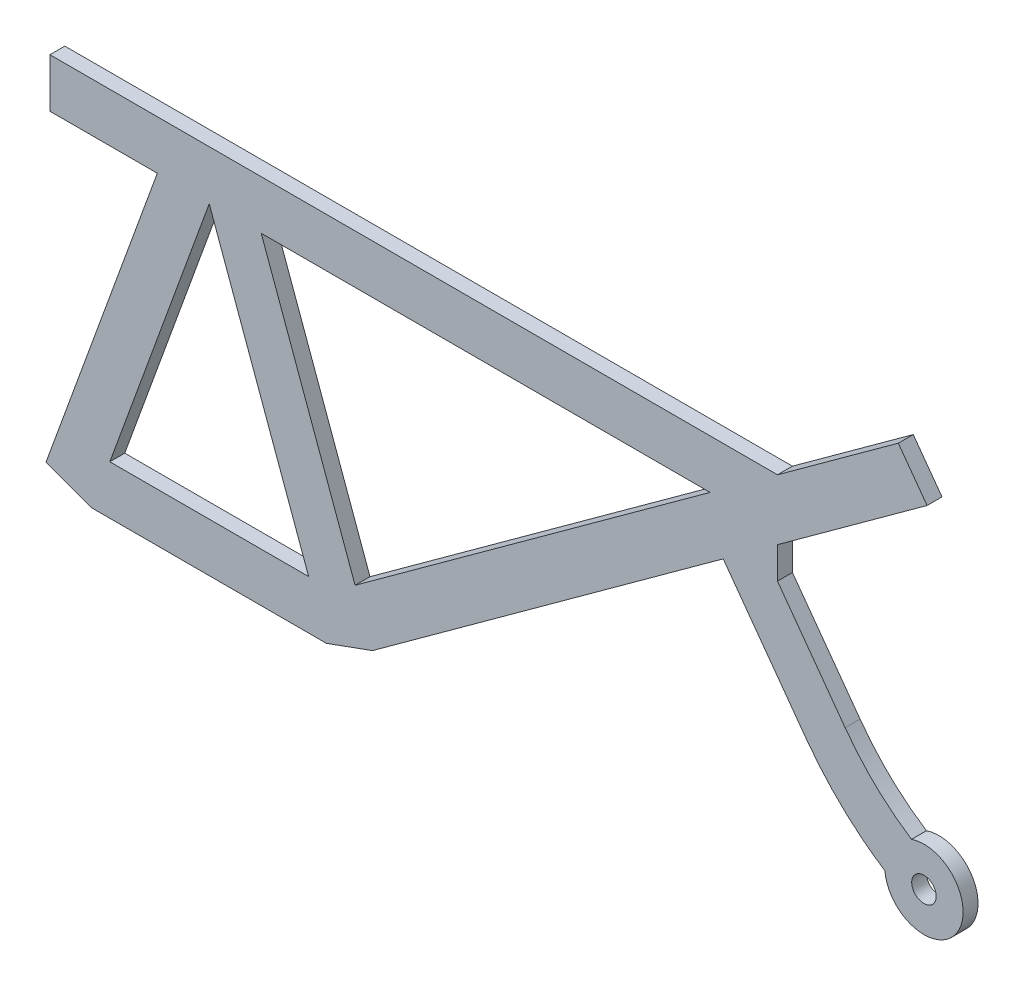
ISO-10303-21;
HEADER;
FILE_DESCRIPTION(('STEP AP214'),'2;1');
FILE_NAME('part.step','',(''),(''),'','','');
FILE_SCHEMA(('AUTOMOTIVE_DESIGN { 1 0 10303 214 1 1 1 1 }'));
ENDSEC;
DATA;
#1=APPLICATION_CONTEXT('core data for automotive mechanical design processes');
#2=APPLICATION_PROTOCOL_DEFINITION('international standard','automotive_design',2000,#1);
#3=PRODUCT_CONTEXT('',#1,'mechanical');
#4=PRODUCT('Part','Part','',(#3));
#5=PRODUCT_RELATED_PRODUCT_CATEGORY('part','',(#4));
#6=PRODUCT_DEFINITION_FORMATION('','',#4);
#7=PRODUCT_DEFINITION_CONTEXT('part definition',#1,'design');
#8=PRODUCT_DEFINITION('design','',#6,#7);
#9=PRODUCT_DEFINITION_SHAPE('','',#8);
#10=(LENGTH_UNIT() NAMED_UNIT(*) SI_UNIT(.MILLI.,.METRE.));
#11=(NAMED_UNIT(*) PLANE_ANGLE_UNIT() SI_UNIT($,.RADIAN.));
#12=(NAMED_UNIT(*) SI_UNIT($,.STERADIAN.) SOLID_ANGLE_UNIT());
#13=UNCERTAINTY_MEASURE_WITH_UNIT(LENGTH_MEASURE(1.E-05),#10,'distance_accuracy_value','');
#14=(GEOMETRIC_REPRESENTATION_CONTEXT(3) GLOBAL_UNCERTAINTY_ASSIGNED_CONTEXT((#13)) GLOBAL_UNIT_ASSIGNED_CONTEXT((#10,
#11,#12)) REPRESENTATION_CONTEXT('',''));
#15=CARTESIAN_POINT('',(0.,0.,0.));
#16=DIRECTION('',(0.,0.,1.));
#17=DIRECTION('',(1.,0.,0.));
#18=AXIS2_PLACEMENT_3D('',#15,#16,#17);
#19=CARTESIAN_POINT('',(102.772821488361,27.459237922697,3.048));
#20=DIRECTION('',(0.,0.,-1.));
#21=DIRECTION('',(-1.,0.,0.));
#22=AXIS2_PLACEMENT_3D('',#19,#20,#21);
#23=PLANE('',#22);
#24=DIRECTION('',(-0.342020143325667,-0.939692620785909,0.));
#25=VECTOR('',#24,1.);
#26=CARTESIAN_POINT('',(-53.6400439307904,6.57979856674335,3.048));
#27=LINE('',#26,#25);
#28=CARTESIAN_POINT('',(-33.3383362406557,62.358282021757,3.048));
#29=VERTEX_POINT('',#28);
#30=CARTESIAN_POINT('',(-53.6400439307904,6.57979856674335,3.048));
#31=VERTEX_POINT('',#30);
#32=EDGE_CURVE('E194',#29,#31,#27,.T.);
#33=ORIENTED_EDGE('',*,*,#32,.F.);
#34=DIRECTION('',(-0.342020143325666,0.939692620785909,0.));
#35=VECTOR('',#34,1.);
#36=CARTESIAN_POINT('',(-13.0366285505211,6.57979856674336,3.048));
#37=LINE('',#36,#35);
#38=CARTESIAN_POINT('',(-13.0366285505211,6.57979856674336,3.048));
#39=VERTEX_POINT('',#38);
#40=EDGE_CURVE('E212',#39,#29,#37,.T.);
#41=ORIENTED_EDGE('',*,*,#40,.F.);
#42=DIRECTION('',(1.,0.,0.));
#43=VECTOR('',#42,1.);
#44=CARTESIAN_POINT('',(-13.0366285505211,6.57979856674336,3.048));
#45=LINE('',#44,#43);
#46=EDGE_CURVE('E202',#31,#39,#45,.T.);
#47=ORIENTED_EDGE('',*,*,#46,.F.);
#48=EDGE_LOOP('',(#33,#41,#47));
#49=FACE_BOUND('',#48,.T.);
#50=DIRECTION('',(0.939692620785909,0.342020143325666,0.));
#51=VECTOR('',#50,1.);
#52=CARTESIAN_POINT('',(0.,0.,3.048));
#53=LINE('',#52,#51);
#54=CARTESIAN_POINT('',(-9.3969262078591,-3.42020143325667,3.048));
#55=VERTEX_POINT('',#54);
#56=CARTESIAN_POINT('',(0.,0.,3.048));
#57=VERTEX_POINT('',#56);
#58=EDGE_CURVE('E246',#55,#57,#53,.T.);
#59=ORIENTED_EDGE('',*,*,#58,.T.);
#60=DIRECTION('',(0.809016994374946,0.587785252292475,0.));
#61=VECTOR('',#60,1.);
#62=CARTESIAN_POINT('',(0.,0.,3.048));
#63=LINE('',#62,#61);
#64=CARTESIAN_POINT('',(71.6228082572284,52.0370161740501,3.048));
#65=VERTEX_POINT('',#64);
#66=EDGE_CURVE('E249',#57,#65,#63,.T.);
#67=ORIENTED_EDGE('',*,*,#66,.T.);
#68=DIRECTION('',(0.587785252292475,-0.809016994374946,0.));
#69=VECTOR('',#68,1.);
#70=CARTESIAN_POINT('',(88.5016698321651,28.8052562641717,3.048));
#71=LINE('',#70,#69);
#72=CARTESIAN_POINT('',(88.5016698321651,28.8052562641717,3.048));
#73=VERTEX_POINT('',#72);
#74=EDGE_CURVE('E252',#65,#73,#71,.T.);
#75=ORIENTED_EDGE('',*,*,#74,.T.);
#76=CARTESIAN_POINT('',(88.5016698321651,28.8052562641717,3.048));
#77=CARTESIAN_POINT('',(92.9669788591866,22.6592856506136,3.048));
#78=CARTESIAN_POINT('',(98.410551954177,17.4106096780782,3.048));
#79=CARTESIAN_POINT('',(104.704030367236,13.3418639731304,3.048));
#80=B_SPLINE_CURVE_WITH_KNOTS('',3,(#76,#77,#78,#79),.UNSPECIFIED.,.F.,.F.,(4,4),
(0.500000000049882,0.915853648382972),.UNSPECIFIED.);
#81=CARTESIAN_POINT('',(104.704030367236,13.3418639731304,3.048));
#82=VERTEX_POINT('',#81);
#83=EDGE_CURVE('E254',#73,#82,#80,.T.);
#84=ORIENTED_EDGE('',*,*,#83,.T.);
#85=DIRECTION('',(-0.542978817044891,-0.83974639281186,0.));
#86=VECTOR('',#85,1.);
#87=CARTESIAN_POINT('',(104.704030367236,13.3418639731304,3.048));
#88=LINE('',#87,#86);
#89=CARTESIAN_POINT('',(104.658496811566,13.2714438426838,3.048));
#90=VERTEX_POINT('',#89);
#91=EDGE_CURVE('E259',#82,#90,#88,.T.);
#92=ORIENTED_EDGE('',*,*,#91,.T.);
#93=CARTESIAN_POINT('',(112.61759651,14.07979857,3.048));
#94=DIRECTION('',(0.,0.,1.));
#95=DIRECTION('',(1.,0.,0.));
#96=AXIS2_PLACEMENT_3D('',#93,#94,#95);
#97=CIRCLE('',#96,8.00004408580249);
#98=CARTESIAN_POINT('',(110.08773170913,21.6692972006147,3.048));
#99=VERTEX_POINT('',#98);
#100=EDGE_CURVE('E349',#90,#99,#97,.T.);
#101=ORIENTED_EDGE('',*,*,#100,.T.);
#102=CARTESIAN_POINT('',(110.08773170913,21.6692972006147,3.048));
#103=CARTESIAN_POINT('',(107.476268967347,23.357612805577,3.048));
#104=CARTESIAN_POINT('',(103.815433620259,26.2626909339763,3.048));
#105=CARTESIAN_POINT('',(99.4673187755361,30.8206912762715,3.048));
#106=CARTESIAN_POINT('',(97.4636600162189,33.3405273525534,3.048));
#107=CARTESIAN_POINT('',(96.5240181199206,34.6338334702196,3.048));
#108=B_SPLINE_CURVE_WITH_KNOTS('',3,(#102,#103,#104,#105,#106,#107),.UNSPECIFIED.,.F.,.F.,(4,1,
1,4),(0.500000000049882,0.707926824216427,0.8118902362997,0.915853648382972),.UNSPECIFIED.);
#109=CARTESIAN_POINT('',(96.5240181199206,34.6338334702196,3.048));
#110=VERTEX_POINT('',#109);
#111=EDGE_CURVE('E343',#99,#110,#108,.T.);
#112=ORIENTED_EDGE('',*,*,#111,.T.);
#113=DIRECTION('',(-0.587785252292475,0.809016994374946,0.));
#114=VECTOR('',#113,1.);
#115=CARTESIAN_POINT('',(96.5240181199206,34.6338334702196,3.048));
#116=LINE('',#115,#114);
#117=CARTESIAN_POINT('',(82.7118472280432,53.6446557682579,3.048));
#118=VERTEX_POINT('',#117);
#119=EDGE_CURVE('E348',#110,#118,#116,.T.);
#120=ORIENTED_EDGE('',*,*,#119,.T.);
#121=DIRECTION('',(0.,1.,0.));
#122=VECTOR('',#121,1.);
#123=CARTESIAN_POINT('',(82.7118472280432,60.0936745810559,3.048));
#124=LINE('',#123,#122);
#125=CARTESIAN_POINT('',(82.7118472280432,60.0936745810559,3.048));
#126=VERTEX_POINT('',#125);
#127=EDGE_CURVE('E354',#118,#126,#124,.T.);
#128=ORIENTED_EDGE('',*,*,#127,.T.);
#129=DIRECTION('',(0.809016994374946,0.587785252292475,0.));
#130=VECTOR('',#129,1.);
#131=CARTESIAN_POINT('',(82.7118472280432,60.0936745810559,3.048));
#132=LINE('',#131,#130);
#133=CARTESIAN_POINT('',(113.262379212492,82.2899353209465,3.048));
#134=VERTEX_POINT('',#133);
#135=EDGE_CURVE('E356',#126,#134,#132,.T.);
#136=ORIENTED_EDGE('',*,*,#135,.T.);
#137=DIRECTION('',(-0.587785252292475,0.809016994374946,0.));
#138=VECTOR('',#137,1.);
#139=CARTESIAN_POINT('',(113.262379212492,82.2899353209465,3.048));
#140=LINE('',#139,#138);
#141=CARTESIAN_POINT('',(107.384526689568,90.3801052646959,3.048));
#142=VERTEX_POINT('',#141);
#143=EDGE_CURVE('E358',#134,#142,#140,.T.);
#144=ORIENTED_EDGE('',*,*,#143,.T.);
#145=DIRECTION('',(-0.809016994374947,-0.587785252292474,0.));
#146=VECTOR('',#145,1.);
#147=CARTESIAN_POINT('',(82.7118472280432,72.4543543560539,3.048));
#148=LINE('',#147,#146);
#149=CARTESIAN_POINT('',(82.7118472280432,72.4543543560539,3.048));
#150=VERTEX_POINT('',#149);
#151=EDGE_CURVE('E360',#142,#150,#148,.T.);
#152=ORIENTED_EDGE('',*,*,#151,.T.);
#153=DIRECTION('',(-1.,0.,0.));
#154=VECTOR('',#153,1.);
#155=CARTESIAN_POINT('',(-5.87785252292476,72.4543543560539,3.048));
#156=LINE('',#155,#154);
#157=CARTESIAN_POINT('',(-65.8778525229248,72.4543543560539,3.048));
#158=VERTEX_POINT('',#157);
#159=EDGE_CURVE('E362',#150,#158,#156,.T.);
#160=ORIENTED_EDGE('',*,*,#159,.T.);
#161=DIRECTION('',(0.,-1.,0.));
#162=VECTOR('',#161,1.);
#163=CARTESIAN_POINT('',(-65.8778525229248,62.4543543560539,3.048));
#164=LINE('',#163,#162);
#165=CARTESIAN_POINT('',(-65.8778525229248,62.4543543560539,3.048));
#166=VERTEX_POINT('',#165);
#167=EDGE_CURVE('E364',#158,#166,#164,.T.);
#168=ORIENTED_EDGE('',*,*,#167,.T.);
#169=DIRECTION('',(1.,0.,0.));
#170=VECTOR('',#169,1.);
#171=CARTESIAN_POINT('',(-43.9451464953943,62.4543543560539,3.048));
#172=LINE('',#171,#170);
#173=CARTESIAN_POINT('',(-43.9451464953943,62.4543543560539,3.048));
#174=VERTEX_POINT('',#173);
#175=EDGE_CURVE('E366',#166,#174,#172,.T.);
#176=ORIENTED_EDGE('',*,*,#175,.T.);
#177=DIRECTION('',(-0.342020143325667,-0.939692620785909,0.));
#178=VECTOR('',#177,1.);
#179=CARTESIAN_POINT('',(-66.6766724813115,0.,3.048));
#180=LINE('',#179,#178);
#181=CARTESIAN_POINT('',(-66.6766724813115,0.,3.048));
#182=VERTEX_POINT('',#181);
#183=EDGE_CURVE('E368',#174,#182,#180,.T.);
#184=ORIENTED_EDGE('',*,*,#183,.T.);
#185=DIRECTION('',(0.93969262078591,-0.342020143325664,0.));
#186=VECTOR('',#185,1.);
#187=CARTESIAN_POINT('',(-66.6766724813115,0.,3.048));
#188=LINE('',#187,#186);
#189=CARTESIAN_POINT('',(-57.2797462734524,-3.42020143325661,3.048));
#190=VERTEX_POINT('',#189);
#191=EDGE_CURVE('E370',#182,#190,#188,.T.);
#192=ORIENTED_EDGE('',*,*,#191,.T.);
#193=DIRECTION('',(1.,0.,0.));
#194=VECTOR('',#193,1.);
#195=CARTESIAN_POINT('',(-9.3969262078591,-3.42020143325667,3.048));
#196=LINE('',#195,#194);
#197=EDGE_CURVE('E372',#190,#55,#196,.T.);
#198=ORIENTED_EDGE('',*,*,#197,.T.);
#199=EDGE_LOOP('',(#59,#67,#75,#84,#92,#101,#112,#120,#128,#136,#144,#152,#160,#168,#176,#184,
#192,#198));
#200=FACE_BOUND('',#199,.T.);
#201=DIRECTION('',(-1.,0.,0.));
#202=VECTOR('',#201,1.);
#203=CARTESIAN_POINT('',(-5.87785252292476,62.4543543560539,3.048));
#204=LINE('',#203,#202);
#205=CARTESIAN_POINT('',(68.9480280233315,62.4543543560539,3.048));
#206=VERTEX_POINT('',#205);
#207=CARTESIAN_POINT('',(-22.7315259859172,62.4543543560539,3.048));
#208=VERTEX_POINT('',#207);
#209=EDGE_CURVE('E224',#206,#208,#204,.T.);
#210=ORIENTED_EDGE('',*,*,#209,.F.);
#211=DIRECTION('',(0.809016994374946,0.587785252292475,0.));
#212=VECTOR('',#211,1.);
#213=CARTESIAN_POINT('',(-3.55803362154996,9.77561703286894,3.048));
#214=LINE('',#213,#212);
#215=CARTESIAN_POINT('',(-3.55803362154997,9.77561703286895,3.048));
#216=VERTEX_POINT('',#215);
#217=EDGE_CURVE('E230',#216,#206,#214,.T.);
#218=ORIENTED_EDGE('',*,*,#217,.F.);
#219=DIRECTION('',(0.342020143325666,-0.939692620785909,0.));
#220=VECTOR('',#219,1.);
#221=CARTESIAN_POINT('',(-3.55803362154996,9.77561703286894,3.048));
#222=LINE('',#221,#220);
#223=EDGE_CURVE('E226',#208,#216,#222,.T.);
#224=ORIENTED_EDGE('',*,*,#223,.F.);
#225=EDGE_LOOP('',(#210,#218,#224));
#226=FACE_BOUND('',#225,.T.);
#227=CARTESIAN_POINT('',(112.61759651,14.07979857,3.048));
#228=DIRECTION('',(0.,0.,1.));
#229=DIRECTION('',(1.,0.,0.));
#230=AXIS2_PLACEMENT_3D('',#227,#228,#229);
#231=CIRCLE('',#230,2.49999999999999);
#232=CARTESIAN_POINT('',(115.11759651,14.07979857,3.048));
#233=VERTEX_POINT('',#232);
#234=EDGE_CURVE('E218',#233,#233,#231,.T.);
#235=ORIENTED_EDGE('',*,*,#234,.F.);
#236=EDGE_LOOP('',(#235));
#237=FACE_BOUND('',#236,.T.);
#238=ADVANCED_FACE('F33',(#49,#200,#226,#237),#23,.F.);
#239=CARTESIAN_POINT('',(102.772821488361,27.459237922697,0.));
#240=DIRECTION('',(0.,0.,-1.));
#241=DIRECTION('',(-1.,0.,0.));
#242=AXIS2_PLACEMENT_3D('',#239,#240,#241);
#243=PLANE('',#242);
#244=DIRECTION('',(-0.342020143325666,0.939692620785909,0.));
#245=VECTOR('',#244,1.);
#246=CARTESIAN_POINT('',(-13.0366285505211,6.57979856674336,0.));
#247=LINE('',#246,#245);
#248=CARTESIAN_POINT('',(-13.0366285505211,6.57979856674336,0.));
#249=VERTEX_POINT('',#248);
#250=CARTESIAN_POINT('',(-33.3383362406557,62.358282021757,0.));
#251=VERTEX_POINT('',#250);
#252=EDGE_CURVE('E203',#249,#251,#247,.T.);
#253=ORIENTED_EDGE('',*,*,#252,.T.);
#254=DIRECTION('',(-0.342020143325667,-0.939692620785909,0.));
#255=VECTOR('',#254,1.);
#256=CARTESIAN_POINT('',(-53.6400439307904,6.57979856674335,0.));
#257=LINE('',#256,#255);
#258=CARTESIAN_POINT('',(-53.6400439307904,6.57979856674335,0.));
#259=VERTEX_POINT('',#258);
#260=EDGE_CURVE('E56',#251,#259,#257,.T.);
#261=ORIENTED_EDGE('',*,*,#260,.T.);
#262=DIRECTION('',(1.,0.,0.));
#263=VECTOR('',#262,1.);
#264=CARTESIAN_POINT('',(-13.0366285505211,6.57979856674336,0.));
#265=LINE('',#264,#263);
#266=EDGE_CURVE('E208',#259,#249,#265,.T.);
#267=ORIENTED_EDGE('',*,*,#266,.T.);
#268=EDGE_LOOP('',(#253,#261,#267));
#269=FACE_BOUND('',#268,.T.);
#270=DIRECTION('',(0.939692620785909,0.342020143325666,0.));
#271=VECTOR('',#270,1.);
#272=CARTESIAN_POINT('',(0.,0.,0.));
#273=LINE('',#272,#271);
#274=CARTESIAN_POINT('',(-9.3969262078591,-3.42020143325667,0.));
#275=VERTEX_POINT('',#274);
#276=CARTESIAN_POINT('',(0.,0.,0.));
#277=VERTEX_POINT('',#276);
#278=EDGE_CURVE('E245',#275,#277,#273,.T.);
#279=ORIENTED_EDGE('',*,*,#278,.F.);
#280=DIRECTION('',(1.,0.,0.));
#281=VECTOR('',#280,1.);
#282=CARTESIAN_POINT('',(-9.3969262078591,-3.42020143325667,0.));
#283=LINE('',#282,#281);
#284=CARTESIAN_POINT('',(-57.2797462734524,-3.42020143325661,0.));
#285=VERTEX_POINT('',#284);
#286=EDGE_CURVE('E250',#285,#275,#283,.T.);
#287=ORIENTED_EDGE('',*,*,#286,.F.);
#288=DIRECTION('',(0.93969262078591,-0.342020143325664,0.));
#289=VECTOR('',#288,1.);
#290=CARTESIAN_POINT('',(-66.6766724813115,0.,0.));
#291=LINE('',#290,#289);
#292=CARTESIAN_POINT('',(-66.6766724813115,0.,0.));
#293=VERTEX_POINT('',#292);
#294=EDGE_CURVE('E418',#293,#285,#291,.T.);
#295=ORIENTED_EDGE('',*,*,#294,.F.);
#296=DIRECTION('',(-0.342020143325667,-0.939692620785909,0.));
#297=VECTOR('',#296,1.);
#298=CARTESIAN_POINT('',(-66.6766724813115,0.,0.));
#299=LINE('',#298,#297);
#300=CARTESIAN_POINT('',(-43.9451464953943,62.4543543560539,0.));
#301=VERTEX_POINT('',#300);
#302=EDGE_CURVE('E416',#301,#293,#299,.T.);
#303=ORIENTED_EDGE('',*,*,#302,.F.);
#304=DIRECTION('',(1.,0.,0.));
#305=VECTOR('',#304,1.);
#306=CARTESIAN_POINT('',(-43.9451464953943,62.4543543560539,0.));
#307=LINE('',#306,#305);
#308=CARTESIAN_POINT('',(-65.8778525229248,62.4543543560539,0.));
#309=VERTEX_POINT('',#308);
#310=EDGE_CURVE('E414',#309,#301,#307,.T.);
#311=ORIENTED_EDGE('',*,*,#310,.F.);
#312=DIRECTION('',(0.,-1.,0.));
#313=VECTOR('',#312,1.);
#314=CARTESIAN_POINT('',(-65.8778525229248,62.4543543560539,0.));
#315=LINE('',#314,#313);
#316=CARTESIAN_POINT('',(-65.8778525229248,72.4543543560539,0.));
#317=VERTEX_POINT('',#316);
#318=EDGE_CURVE('E412',#317,#309,#315,.T.);
#319=ORIENTED_EDGE('',*,*,#318,.F.);
#320=DIRECTION('',(-1.,0.,0.));
#321=VECTOR('',#320,1.);
#322=CARTESIAN_POINT('',(-5.87785252292476,72.4543543560539,0.));
#323=LINE('',#322,#321);
#324=CARTESIAN_POINT('',(82.7118472280432,72.4543543560539,0.));
#325=VERTEX_POINT('',#324);
#326=EDGE_CURVE('E410',#325,#317,#323,.T.);
#327=ORIENTED_EDGE('',*,*,#326,.F.);
#328=DIRECTION('',(-0.809016994374947,-0.587785252292474,0.));
#329=VECTOR('',#328,1.);
#330=CARTESIAN_POINT('',(82.7118472280432,72.4543543560539,0.));
#331=LINE('',#330,#329);
#332=CARTESIAN_POINT('',(107.384526689568,90.3801052646959,0.));
#333=VERTEX_POINT('',#332);
#334=EDGE_CURVE('E407',#333,#325,#331,.T.);
#335=ORIENTED_EDGE('',*,*,#334,.F.);
#336=DIRECTION('',(-0.587785252292475,0.809016994374946,0.));
#337=VECTOR('',#336,1.);
#338=CARTESIAN_POINT('',(113.262379212492,82.2899353209465,0.));
#339=LINE('',#338,#337);
#340=CARTESIAN_POINT('',(113.262379212492,82.2899353209465,0.));
#341=VERTEX_POINT('',#340);
#342=EDGE_CURVE('E405',#341,#333,#339,.T.);
#343=ORIENTED_EDGE('',*,*,#342,.F.);
#344=DIRECTION('',(0.809016994374946,0.587785252292475,0.));
#345=VECTOR('',#344,1.);
#346=CARTESIAN_POINT('',(82.7118472280432,60.0936745810559,0.));
#347=LINE('',#346,#345);
#348=CARTESIAN_POINT('',(82.7118472280432,60.0936745810559,0.));
#349=VERTEX_POINT('',#348);
#350=EDGE_CURVE('E403',#349,#341,#347,.T.);
#351=ORIENTED_EDGE('',*,*,#350,.F.);
#352=DIRECTION('',(0.,1.,0.));
#353=VECTOR('',#352,1.);
#354=CARTESIAN_POINT('',(82.7118472280432,60.0936745810559,0.));
#355=LINE('',#354,#353);
#356=CARTESIAN_POINT('',(82.7118472280432,53.6446557682579,0.));
#357=VERTEX_POINT('',#356);
#358=EDGE_CURVE('E401',#357,#349,#355,.T.);
#359=ORIENTED_EDGE('',*,*,#358,.F.);
#360=DIRECTION('',(-0.587785252292475,0.809016994374946,0.));
#361=VECTOR('',#360,1.);
#362=CARTESIAN_POINT('',(96.5240181199206,34.6338334702196,0.));
#363=LINE('',#362,#361);
#364=CARTESIAN_POINT('',(96.5240181199206,34.6338334702196,0.));
#365=VERTEX_POINT('',#364);
#366=EDGE_CURVE('E396',#365,#357,#363,.T.);
#367=ORIENTED_EDGE('',*,*,#366,.F.);
#368=CARTESIAN_POINT('',(110.08773170913,21.6692972006147,0.));
#369=CARTESIAN_POINT('',(107.476268967347,23.357612805577,0.));
#370=CARTESIAN_POINT('',(103.815433620259,26.2626909339763,0.));
#371=CARTESIAN_POINT('',(99.4673187755361,30.8206912762715,0.));
#372=CARTESIAN_POINT('',(97.4636600162189,33.3405273525534,0.));
#373=CARTESIAN_POINT('',(96.5240181199206,34.6338334702196,0.));
#374=B_SPLINE_CURVE_WITH_KNOTS('',3,(#368,#369,#370,#371,#372,#373),.UNSPECIFIED.,.F.,.F.,(4,1,
1,4),(0.500000000049882,0.707926824216427,0.8118902362997,0.915853648382972),.UNSPECIFIED.);
#375=CARTESIAN_POINT('',(110.08773170913,21.6692972006147,0.));
#376=VERTEX_POINT('',#375);
#377=EDGE_CURVE('E392',#376,#365,#374,.T.);
#378=ORIENTED_EDGE('',*,*,#377,.F.);
#379=CARTESIAN_POINT('',(112.61759651,14.07979857,0.));
#380=DIRECTION('',(0.,0.,1.));
#381=DIRECTION('',(1.,0.,0.));
#382=AXIS2_PLACEMENT_3D('',#379,#380,#381);
#383=CIRCLE('',#382,8.00004408580249);
#384=CARTESIAN_POINT('',(104.658496811566,13.2714438426838,0.));
#385=VERTEX_POINT('',#384);
#386=EDGE_CURVE('E390',#385,#376,#383,.T.);
#387=ORIENTED_EDGE('',*,*,#386,.F.);
#388=DIRECTION('',(-0.542978817044891,-0.83974639281186,0.));
#389=VECTOR('',#388,1.);
#390=CARTESIAN_POINT('',(104.704030367236,13.3418639731304,0.));
#391=LINE('',#390,#389);
#392=CARTESIAN_POINT('',(104.704030367236,13.3418639731304,0.));
#393=VERTEX_POINT('',#392);
#394=EDGE_CURVE('E385',#393,#385,#391,.T.);
#395=ORIENTED_EDGE('',*,*,#394,.F.);
#396=CARTESIAN_POINT('',(88.5016698321651,28.8052562641717,0.));
#397=CARTESIAN_POINT('',(92.9669788591866,22.6592856506136,0.));
#398=CARTESIAN_POINT('',(98.410551954177,17.4106096780782,0.));
#399=CARTESIAN_POINT('',(104.704030367236,13.3418639731304,0.));
#400=B_SPLINE_CURVE_WITH_KNOTS('',3,(#396,#397,#398,#399),.UNSPECIFIED.,.F.,.F.,(4,4),
(0.500000000049882,0.915853648382972),.UNSPECIFIED.);
#401=CARTESIAN_POINT('',(88.5016698321651,28.8052562641717,0.));
#402=VERTEX_POINT('',#401);
#403=EDGE_CURVE('E381',#402,#393,#400,.T.);
#404=ORIENTED_EDGE('',*,*,#403,.F.);
#405=DIRECTION('',(0.587785252292475,-0.809016994374946,0.));
#406=VECTOR('',#405,1.);
#407=CARTESIAN_POINT('',(88.5016698321651,28.8052562641717,0.));
#408=LINE('',#407,#406);
#409=CARTESIAN_POINT('',(71.6228082572284,52.0370161740501,0.));
#410=VERTEX_POINT('',#409);
#411=EDGE_CURVE('E379',#410,#402,#408,.T.);
#412=ORIENTED_EDGE('',*,*,#411,.F.);
#413=DIRECTION('',(0.809016994374946,0.587785252292475,0.));
#414=VECTOR('',#413,1.);
#415=CARTESIAN_POINT('',(0.,0.,0.));
#416=LINE('',#415,#414);
#417=EDGE_CURVE('E377',#277,#410,#416,.T.);
#418=ORIENTED_EDGE('',*,*,#417,.F.);
#419=EDGE_LOOP('',(#279,#287,#295,#303,#311,#319,#327,#335,#343,#351,#359,#367,#378,#387,#395,
#404,#412,#418));
#420=FACE_BOUND('',#419,.T.);
#421=DIRECTION('',(0.809016994374946,0.587785252292475,0.));
#422=VECTOR('',#421,1.);
#423=CARTESIAN_POINT('',(-3.55803362154996,9.77561703286894,0.));
#424=LINE('',#423,#422);
#425=CARTESIAN_POINT('',(-3.55803362154996,9.77561703286894,0.));
#426=VERTEX_POINT('',#425);
#427=CARTESIAN_POINT('',(68.9480280233315,62.4543543560539,0.));
#428=VERTEX_POINT('',#427);
#429=EDGE_CURVE('E227',#426,#428,#424,.T.);
#430=ORIENTED_EDGE('',*,*,#429,.T.);
#431=DIRECTION('',(-1.,0.,0.));
#432=VECTOR('',#431,1.);
#433=CARTESIAN_POINT('',(-5.87785252292476,62.4543543560539,0.));
#434=LINE('',#433,#432);
#435=CARTESIAN_POINT('',(-22.7315259859172,62.4543543560539,0.));
#436=VERTEX_POINT('',#435);
#437=EDGE_CURVE('E209',#428,#436,#434,.T.);
#438=ORIENTED_EDGE('',*,*,#437,.T.);
#439=DIRECTION('',(0.342020143325666,-0.939692620785909,0.));
#440=VECTOR('',#439,1.);
#441=CARTESIAN_POINT('',(-3.55803362154996,9.77561703286894,0.));
#442=LINE('',#441,#440);
#443=EDGE_CURVE('E235',#436,#426,#442,.T.);
#444=ORIENTED_EDGE('',*,*,#443,.T.);
#445=EDGE_LOOP('',(#430,#438,#444));
#446=FACE_BOUND('',#445,.T.);
#447=CARTESIAN_POINT('',(112.61759651,14.07979857,0.));
#448=DIRECTION('',(0.,0.,1.));
#449=DIRECTION('',(1.,0.,0.));
#450=AXIS2_PLACEMENT_3D('',#447,#448,#449);
#451=CIRCLE('',#450,2.49999999999999);
#452=CARTESIAN_POINT('',(115.11759651,14.07979857,0.));
#453=VERTEX_POINT('',#452);
#454=EDGE_CURVE('E715',#453,#453,#451,.T.);
#455=ORIENTED_EDGE('',*,*,#454,.T.);
#456=EDGE_LOOP('',(#455));
#457=FACE_BOUND('',#456,.T.);
#458=ADVANCED_FACE('F281',(#269,#420,#446,#457),#243,.T.);
#459=CARTESIAN_POINT('',(0.,0.,3.048));
#460=DIRECTION('',(-0.342020143325667,0.939692620785909,0.));
#461=DIRECTION('',(-0.939692620785909,-0.342020143325667,0.));
#462=AXIS2_PLACEMENT_3D('',#459,#460,#461);
#463=PLANE('',#462);
#464=ORIENTED_EDGE('',*,*,#278,.T.);
#465=DIRECTION('',(0.,0.,-1.));
#466=VECTOR('',#465,1.);
#467=CARTESIAN_POINT('',(0.,0.,3.048));
#468=LINE('',#467,#466);
#469=EDGE_CURVE('E11',#57,#277,#468,.T.);
#470=ORIENTED_EDGE('',*,*,#469,.F.);
#471=ORIENTED_EDGE('',*,*,#58,.F.);
#472=DIRECTION('',(0.,0.,-1.));
#473=VECTOR('',#472,1.);
#474=CARTESIAN_POINT('',(-9.3969262078591,-3.42020143325667,3.048));
#475=LINE('',#474,#473);
#476=EDGE_CURVE('E374',#55,#275,#475,.T.);
#477=ORIENTED_EDGE('',*,*,#476,.T.);
#478=EDGE_LOOP('',(#464,#470,#471,#477));
#479=FACE_BOUND('',#478,.T.);
#480=ADVANCED_FACE('F35',(#479),#463,.F.);
#481=CARTESIAN_POINT('',(0.,0.,3.048));
#482=DIRECTION('',(-0.587785252292475,0.809016994374946,0.));
#483=DIRECTION('',(-0.809016994374946,-0.587785252292475,0.));
#484=AXIS2_PLACEMENT_3D('',#481,#482,#483);
#485=PLANE('',#484);
#486=ORIENTED_EDGE('',*,*,#417,.T.);
#487=DIRECTION('',(0.,0.,-1.));
#488=VECTOR('',#487,1.);
#489=CARTESIAN_POINT('',(71.6228082572284,52.0370161740501,3.048));
#490=LINE('',#489,#488);
#491=EDGE_CURVE('E41',#65,#410,#490,.T.);
#492=ORIENTED_EDGE('',*,*,#491,.F.);
#493=ORIENTED_EDGE('',*,*,#66,.F.);
#494=ORIENTED_EDGE('',*,*,#469,.T.);
#495=EDGE_LOOP('',(#486,#492,#493,#494));
#496=FACE_BOUND('',#495,.T.);
#497=ADVANCED_FACE('F274',(#496),#485,.F.);
#498=CARTESIAN_POINT('',(88.5016698321651,28.8052562641717,3.048));
#499=DIRECTION('',(0.809016994374946,0.587785252292475,0.));
#500=DIRECTION('',(-0.587785252292475,0.809016994374946,0.));
#501=AXIS2_PLACEMENT_3D('',#498,#499,#500);
#502=PLANE('',#501);
#503=ORIENTED_EDGE('',*,*,#411,.T.);
#504=DIRECTION('',(0.,0.,-1.));
#505=VECTOR('',#504,1.);
#506=CARTESIAN_POINT('',(88.5016698321651,28.8052562641717,3.048));
#507=LINE('',#506,#505);
#508=EDGE_CURVE('E465',#73,#402,#507,.T.);
#509=ORIENTED_EDGE('',*,*,#508,.F.);
#510=ORIENTED_EDGE('',*,*,#74,.F.);
#511=ORIENTED_EDGE('',*,*,#491,.T.);
#512=EDGE_LOOP('',(#503,#509,#510,#511));
#513=FACE_BOUND('',#512,.T.);
#514=ADVANCED_FACE('F270',(#513),#502,.F.);
#515=DIRECTION('',(0.,0.,-1.));
#516=VECTOR('',#515,1.);
#517=SURFACE_OF_LINEAR_EXTRUSION('',#80,#516);
#518=ORIENTED_EDGE('',*,*,#403,.T.);
#519=DIRECTION('',(0.,0.,-1.));
#520=VECTOR('',#519,1.);
#521=CARTESIAN_POINT('',(104.704030367236,13.3418639731304,3.048));
#522=LINE('',#521,#520);
#523=EDGE_CURVE('E462',#82,#393,#522,.T.);
#524=ORIENTED_EDGE('',*,*,#523,.F.);
#525=ORIENTED_EDGE('',*,*,#83,.F.);
#526=ORIENTED_EDGE('',*,*,#508,.T.);
#527=EDGE_LOOP('',(#518,#524,#525,#526));
#528=FACE_BOUND('',#527,.T.);
#529=ADVANCED_FACE('F265',(#528),#517,.F.);
#530=CARTESIAN_POINT('',(104.704030367236,13.3418639731304,3.048));
#531=DIRECTION('',(0.83974639281186,-0.542978817044891,0.));
#532=DIRECTION('',(0.542978817044891,0.83974639281186,0.));
#533=AXIS2_PLACEMENT_3D('',#530,#531,#532);
#534=PLANE('',#533);
#535=ORIENTED_EDGE('',*,*,#394,.T.);
#536=DIRECTION('',(0.,0.,-1.));
#537=VECTOR('',#536,1.);
#538=CARTESIAN_POINT('',(104.658496811566,13.2714438426838,3.048));
#539=LINE('',#538,#537);
#540=EDGE_CURVE('E459',#90,#385,#539,.T.);
#541=ORIENTED_EDGE('',*,*,#540,.F.);
#542=ORIENTED_EDGE('',*,*,#91,.F.);
#543=ORIENTED_EDGE('',*,*,#523,.T.);
#544=EDGE_LOOP('',(#535,#541,#542,#543));
#545=FACE_BOUND('',#544,.T.);
#546=ADVANCED_FACE('F269',(#545),#534,.F.);
#547=CARTESIAN_POINT('',(112.61759651,14.07979857,3.048));
#548=DIRECTION('',(0.,0.,-1.));
#549=DIRECTION('',(-1.,0.,0.));
#550=AXIS2_PLACEMENT_3D('',#547,#548,#549);
#551=CYLINDRICAL_SURFACE('',#550,8.00004408580249);
#552=ORIENTED_EDGE('',*,*,#386,.T.);
#553=DIRECTION('',(0.,0.,-1.));
#554=VECTOR('',#553,1.);
#555=CARTESIAN_POINT('',(110.08773170913,21.6692972006147,3.048));
#556=LINE('',#555,#554);
#557=EDGE_CURVE('E456',#99,#376,#556,.T.);
#558=ORIENTED_EDGE('',*,*,#557,.F.);
#559=ORIENTED_EDGE('',*,*,#100,.F.);
#560=ORIENTED_EDGE('',*,*,#540,.T.);
#561=EDGE_LOOP('',(#552,#558,#559,#560));
#562=FACE_BOUND('',#561,.T.);
#563=ADVANCED_FACE('F341',(#562),#551,.T.);
#564=DIRECTION('',(0.,0.,-1.));
#565=VECTOR('',#564,1.);
#566=SURFACE_OF_LINEAR_EXTRUSION('',#108,#565);
#567=ORIENTED_EDGE('',*,*,#377,.T.);
#568=DIRECTION('',(0.,0.,-1.));
#569=VECTOR('',#568,1.);
#570=CARTESIAN_POINT('',(96.5240181199206,34.6338334702196,3.048));
#571=LINE('',#570,#569);
#572=EDGE_CURVE('E453',#110,#365,#571,.T.);
#573=ORIENTED_EDGE('',*,*,#572,.F.);
#574=ORIENTED_EDGE('',*,*,#111,.F.);
#575=ORIENTED_EDGE('',*,*,#557,.T.);
#576=EDGE_LOOP('',(#567,#573,#574,#575));
#577=FACE_BOUND('',#576,.T.);
#578=ADVANCED_FACE('F337',(#577),#566,.F.);
#579=CARTESIAN_POINT('',(96.5240181199206,34.6338334702196,3.048));
#580=DIRECTION('',(-0.809016994374946,-0.587785252292475,0.));
#581=DIRECTION('',(0.587785252292475,-0.809016994374946,0.));
#582=AXIS2_PLACEMENT_3D('',#579,#580,#581);
#583=PLANE('',#582);
#584=ORIENTED_EDGE('',*,*,#366,.T.);
#585=DIRECTION('',(0.,0.,-1.));
#586=VECTOR('',#585,1.);
#587=CARTESIAN_POINT('',(82.7118472280432,53.6446557682579,3.048));
#588=LINE('',#587,#586);
#589=EDGE_CURVE('E450',#118,#357,#588,.T.);
#590=ORIENTED_EDGE('',*,*,#589,.F.);
#591=ORIENTED_EDGE('',*,*,#119,.F.);
#592=ORIENTED_EDGE('',*,*,#572,.T.);
#593=EDGE_LOOP('',(#584,#590,#591,#592));
#594=FACE_BOUND('',#593,.T.);
#595=ADVANCED_FACE('F333',(#594),#583,.F.);
#596=CARTESIAN_POINT('',(82.7118472280432,60.0936745810559,3.048));
#597=DIRECTION('',(-1.,0.,0.));
#598=DIRECTION('',(0.,0.,1.));
#599=AXIS2_PLACEMENT_3D('',#596,#597,#598);
#600=PLANE('',#599);
#601=ORIENTED_EDGE('',*,*,#358,.T.);
#602=DIRECTION('',(0.,0.,-1.));
#603=VECTOR('',#602,1.);
#604=CARTESIAN_POINT('',(82.7118472280432,60.0936745810559,3.048));
#605=LINE('',#604,#603);
#606=EDGE_CURVE('E447',#126,#349,#605,.T.);
#607=ORIENTED_EDGE('',*,*,#606,.F.);
#608=ORIENTED_EDGE('',*,*,#127,.F.);
#609=ORIENTED_EDGE('',*,*,#589,.T.);
#610=EDGE_LOOP('',(#601,#607,#608,#609));
#611=FACE_BOUND('',#610,.T.);
#612=ADVANCED_FACE('F329',(#611),#600,.F.);
#613=CARTESIAN_POINT('',(82.7118472280432,60.0936745810559,3.048));
#614=DIRECTION('',(-0.587785252292475,0.809016994374946,0.));
#615=DIRECTION('',(-0.809016994374946,-0.587785252292475,0.));
#616=AXIS2_PLACEMENT_3D('',#613,#614,#615);
#617=PLANE('',#616);
#618=ORIENTED_EDGE('',*,*,#350,.T.);
#619=DIRECTION('',(0.,0.,-1.));
#620=VECTOR('',#619,1.);
#621=CARTESIAN_POINT('',(113.262379212492,82.2899353209465,3.048));
#622=LINE('',#621,#620);
#623=EDGE_CURVE('E444',#134,#341,#622,.T.);
#624=ORIENTED_EDGE('',*,*,#623,.F.);
#625=ORIENTED_EDGE('',*,*,#135,.F.);
#626=ORIENTED_EDGE('',*,*,#606,.T.);
#627=EDGE_LOOP('',(#618,#624,#625,#626));
#628=FACE_BOUND('',#627,.T.);
#629=ADVANCED_FACE('F325',(#628),#617,.F.);
#630=CARTESIAN_POINT('',(113.262379212492,82.2899353209465,3.048));
#631=DIRECTION('',(-0.809016994374946,-0.587785252292475,0.));
#632=DIRECTION('',(0.587785252292475,-0.809016994374946,0.));
#633=AXIS2_PLACEMENT_3D('',#630,#631,#632);
#634=PLANE('',#633);
#635=ORIENTED_EDGE('',*,*,#342,.T.);
#636=DIRECTION('',(0.,0.,-1.));
#637=VECTOR('',#636,1.);
#638=CARTESIAN_POINT('',(107.384526689568,90.3801052646959,3.048));
#639=LINE('',#638,#637);
#640=EDGE_CURVE('E441',#142,#333,#639,.T.);
#641=ORIENTED_EDGE('',*,*,#640,.F.);
#642=ORIENTED_EDGE('',*,*,#143,.F.);
#643=ORIENTED_EDGE('',*,*,#623,.T.);
#644=EDGE_LOOP('',(#635,#641,#642,#643));
#645=FACE_BOUND('',#644,.T.);
#646=ADVANCED_FACE('F321',(#645),#634,.F.);
#647=CARTESIAN_POINT('',(82.7118472280432,72.4543543560539,3.048));
#648=DIRECTION('',(0.587785252292474,-0.809016994374947,0.));
#649=DIRECTION('',(0.809016994374947,0.587785252292474,0.));
#650=AXIS2_PLACEMENT_3D('',#647,#648,#649);
#651=PLANE('',#650);
#652=ORIENTED_EDGE('',*,*,#334,.T.);
#653=DIRECTION('',(0.,0.,-1.));
#654=VECTOR('',#653,1.);
#655=CARTESIAN_POINT('',(82.7118472280432,72.4543543560539,3.048));
#656=LINE('',#655,#654);
#657=EDGE_CURVE('E438',#150,#325,#656,.T.);
#658=ORIENTED_EDGE('',*,*,#657,.F.);
#659=ORIENTED_EDGE('',*,*,#151,.F.);
#660=ORIENTED_EDGE('',*,*,#640,.T.);
#661=EDGE_LOOP('',(#652,#658,#659,#660));
#662=FACE_BOUND('',#661,.T.);
#663=ADVANCED_FACE('F317',(#662),#651,.F.);
#664=CARTESIAN_POINT('',(-5.87785252292476,72.4543543560539,3.048));
#665=DIRECTION('',(0.,-1.,0.));
#666=DIRECTION('',(1.,0.,0.));
#667=AXIS2_PLACEMENT_3D('',#664,#665,#666);
#668=PLANE('',#667);
#669=ORIENTED_EDGE('',*,*,#326,.T.);
#670=DIRECTION('',(0.,0.,-1.));
#671=VECTOR('',#670,1.);
#672=CARTESIAN_POINT('',(-65.8778525229248,72.4543543560539,3.048));
#673=LINE('',#672,#671);
#674=EDGE_CURVE('E435',#158,#317,#673,.T.);
#675=ORIENTED_EDGE('',*,*,#674,.F.);
#676=ORIENTED_EDGE('',*,*,#159,.F.);
#677=ORIENTED_EDGE('',*,*,#657,.T.);
#678=EDGE_LOOP('',(#669,#675,#676,#677));
#679=FACE_BOUND('',#678,.T.);
#680=ADVANCED_FACE('F313',(#679),#668,.F.);
#681=CARTESIAN_POINT('',(-65.8778525229248,62.4543543560539,3.048));
#682=DIRECTION('',(1.,0.,0.));
#683=DIRECTION('',(0.,0.,-1.));
#684=AXIS2_PLACEMENT_3D('',#681,#682,#683);
#685=PLANE('',#684);
#686=ORIENTED_EDGE('',*,*,#318,.T.);
#687=DIRECTION('',(0.,0.,-1.));
#688=VECTOR('',#687,1.);
#689=CARTESIAN_POINT('',(-65.8778525229248,62.4543543560539,3.048));
#690=LINE('',#689,#688);
#691=EDGE_CURVE('E432',#166,#309,#690,.T.);
#692=ORIENTED_EDGE('',*,*,#691,.F.);
#693=ORIENTED_EDGE('',*,*,#167,.F.);
#694=ORIENTED_EDGE('',*,*,#674,.T.);
#695=EDGE_LOOP('',(#686,#692,#693,#694));
#696=FACE_BOUND('',#695,.T.);
#697=ADVANCED_FACE('F309',(#696),#685,.F.);
#698=CARTESIAN_POINT('',(-43.9451464953943,62.4543543560539,3.048));
#699=DIRECTION('',(0.,1.,0.));
#700=DIRECTION('',(0.,0.,1.));
#701=AXIS2_PLACEMENT_3D('',#698,#699,#700);
#702=PLANE('',#701);
#703=ORIENTED_EDGE('',*,*,#310,.T.);
#704=DIRECTION('',(0.,0.,-1.));
#705=VECTOR('',#704,1.);
#706=CARTESIAN_POINT('',(-43.9451464953943,62.4543543560539,3.048));
#707=LINE('',#706,#705);
#708=EDGE_CURVE('E429',#174,#301,#707,.T.);
#709=ORIENTED_EDGE('',*,*,#708,.F.);
#710=ORIENTED_EDGE('',*,*,#175,.F.);
#711=ORIENTED_EDGE('',*,*,#691,.T.);
#712=EDGE_LOOP('',(#703,#709,#710,#711));
#713=FACE_BOUND('',#712,.T.);
#714=ADVANCED_FACE('F305',(#713),#702,.F.);
#715=CARTESIAN_POINT('',(-66.6766724813115,0.,3.048));
#716=DIRECTION('',(0.939692620785909,-0.342020143325666,0.));
#717=DIRECTION('',(0.342020143325666,0.939692620785909,0.));
#718=AXIS2_PLACEMENT_3D('',#715,#716,#717);
#719=PLANE('',#718);
#720=ORIENTED_EDGE('',*,*,#302,.T.);
#721=DIRECTION('',(0.,0.,-1.));
#722=VECTOR('',#721,1.);
#723=CARTESIAN_POINT('',(-66.6766724813115,0.,3.048));
#724=LINE('',#723,#722);
#725=EDGE_CURVE('E426',#182,#293,#724,.T.);
#726=ORIENTED_EDGE('',*,*,#725,.F.);
#727=ORIENTED_EDGE('',*,*,#183,.F.);
#728=ORIENTED_EDGE('',*,*,#708,.T.);
#729=EDGE_LOOP('',(#720,#726,#727,#728));
#730=FACE_BOUND('',#729,.T.);
#731=ADVANCED_FACE('F301',(#730),#719,.F.);
#732=CARTESIAN_POINT('',(-66.6766724813115,0.,3.048));
#733=DIRECTION('',(0.342020143325664,0.93969262078591,0.));
#734=DIRECTION('',(-0.93969262078591,0.342020143325664,0.));
#735=AXIS2_PLACEMENT_3D('',#732,#733,#734);
#736=PLANE('',#735);
#737=ORIENTED_EDGE('',*,*,#294,.T.);
#738=DIRECTION('',(0.,0.,-1.));
#739=VECTOR('',#738,1.);
#740=CARTESIAN_POINT('',(-57.2797462734524,-3.42020143325661,3.048));
#741=LINE('',#740,#739);
#742=EDGE_CURVE('E423',#190,#285,#741,.T.);
#743=ORIENTED_EDGE('',*,*,#742,.F.);
#744=ORIENTED_EDGE('',*,*,#191,.F.);
#745=ORIENTED_EDGE('',*,*,#725,.T.);
#746=EDGE_LOOP('',(#737,#743,#744,#745));
#747=FACE_BOUND('',#746,.T.);
#748=ADVANCED_FACE('F297',(#747),#736,.F.);
#749=CARTESIAN_POINT('',(-9.3969262078591,-3.42020143325667,3.048));
#750=DIRECTION('',(0.,1.,0.));
#751=DIRECTION('',(-1.,0.,0.));
#752=AXIS2_PLACEMENT_3D('',#749,#750,#751);
#753=PLANE('',#752);
#754=ORIENTED_EDGE('',*,*,#286,.T.);
#755=ORIENTED_EDGE('',*,*,#476,.F.);
#756=ORIENTED_EDGE('',*,*,#197,.F.);
#757=ORIENTED_EDGE('',*,*,#742,.T.);
#758=EDGE_LOOP('',(#754,#755,#756,#757));
#759=FACE_BOUND('',#758,.T.);
#760=ADVANCED_FACE('F294',(#759),#753,.F.);
#761=CARTESIAN_POINT('',(-5.87785252292476,62.4543543560539,3.048));
#762=DIRECTION('',(0.,-1.,0.));
#763=DIRECTION('',(1.,0.,0.));
#764=AXIS2_PLACEMENT_3D('',#761,#762,#763);
#765=PLANE('',#764);
#766=ORIENTED_EDGE('',*,*,#437,.F.);
#767=DIRECTION('',(0.,0.,-1.));
#768=VECTOR('',#767,1.);
#769=CARTESIAN_POINT('',(68.9480280233315,62.4543543560539,3.048));
#770=LINE('',#769,#768);
#771=EDGE_CURVE('E232',#206,#428,#770,.T.);
#772=ORIENTED_EDGE('',*,*,#771,.F.);
#773=ORIENTED_EDGE('',*,*,#209,.T.);
#774=DIRECTION('',(0.,0.,-1.));
#775=VECTOR('',#774,1.);
#776=CARTESIAN_POINT('',(-22.7315259859172,62.4543543560539,3.048));
#777=LINE('',#776,#775);
#778=EDGE_CURVE('E243',#208,#436,#777,.T.);
#779=ORIENTED_EDGE('',*,*,#778,.T.);
#780=EDGE_LOOP('',(#766,#772,#773,#779));
#781=FACE_BOUND('',#780,.T.);
#782=ADVANCED_FACE('F291',(#781),#765,.T.);
#783=CARTESIAN_POINT('',(-3.55803362154996,9.77561703286894,3.048));
#784=DIRECTION('',(0.939692620785909,0.342020143325666,0.));
#785=DIRECTION('',(-0.342020143325666,0.939692620785909,0.));
#786=AXIS2_PLACEMENT_3D('',#783,#784,#785);
#787=PLANE('',#786);
#788=ORIENTED_EDGE('',*,*,#443,.F.);
#789=ORIENTED_EDGE('',*,*,#778,.F.);
#790=ORIENTED_EDGE('',*,*,#223,.T.);
#791=DIRECTION('',(0.,0.,-1.));
#792=VECTOR('',#791,1.);
#793=CARTESIAN_POINT('',(-3.55803362154996,9.77561703286894,3.048));
#794=LINE('',#793,#792);
#795=EDGE_CURVE('E241',#216,#426,#794,.T.);
#796=ORIENTED_EDGE('',*,*,#795,.T.);
#797=EDGE_LOOP('',(#788,#789,#790,#796));
#798=FACE_BOUND('',#797,.T.);
#799=ADVANCED_FACE('F639',(#798),#787,.T.);
#800=CARTESIAN_POINT('',(-3.55803362154996,9.77561703286894,3.048));
#801=DIRECTION('',(-0.587785252292475,0.809016994374946,0.));
#802=DIRECTION('',(-0.809016994374946,-0.587785252292475,0.));
#803=AXIS2_PLACEMENT_3D('',#800,#801,#802);
#804=PLANE('',#803);
#805=ORIENTED_EDGE('',*,*,#429,.F.);
#806=ORIENTED_EDGE('',*,*,#795,.F.);
#807=ORIENTED_EDGE('',*,*,#217,.T.);
#808=ORIENTED_EDGE('',*,*,#771,.T.);
#809=EDGE_LOOP('',(#805,#806,#807,#808));
#810=FACE_BOUND('',#809,.T.);
#811=ADVANCED_FACE('F650',(#810),#804,.T.);
#812=CARTESIAN_POINT('',(-53.6400439307904,6.57979856674335,3.048));
#813=DIRECTION('',(0.939692620785909,-0.342020143325667,0.));
#814=DIRECTION('',(0.342020143325667,0.939692620785909,0.));
#815=AXIS2_PLACEMENT_3D('',#812,#813,#814);
#816=PLANE('',#815);
#817=ORIENTED_EDGE('',*,*,#260,.F.);
#818=DIRECTION('',(0.,0.,-1.));
#819=VECTOR('',#818,1.);
#820=CARTESIAN_POINT('',(-33.3383362406557,62.358282021757,3.048));
#821=LINE('',#820,#819);
#822=EDGE_CURVE('E198',#29,#251,#821,.T.);
#823=ORIENTED_EDGE('',*,*,#822,.F.);
#824=ORIENTED_EDGE('',*,*,#32,.T.);
#825=DIRECTION('',(0.,0.,-1.));
#826=VECTOR('',#825,1.);
#827=CARTESIAN_POINT('',(-53.6400439307904,6.57979856674335,3.048));
#828=LINE('',#827,#826);
#829=EDGE_CURVE('E197',#31,#259,#828,.T.);
#830=ORIENTED_EDGE('',*,*,#829,.T.);
#831=EDGE_LOOP('',(#817,#823,#824,#830));
#832=FACE_BOUND('',#831,.T.);
#833=ADVANCED_FACE('F196',(#832),#816,.T.);
#834=CARTESIAN_POINT('',(-13.0366285505211,6.57979856674336,3.048));
#835=DIRECTION('',(0.,1.,0.));
#836=DIRECTION('',(-1.,0.,0.));
#837=AXIS2_PLACEMENT_3D('',#834,#835,#836);
#838=PLANE('',#837);
#839=ORIENTED_EDGE('',*,*,#266,.F.);
#840=ORIENTED_EDGE('',*,*,#829,.F.);
#841=ORIENTED_EDGE('',*,*,#46,.T.);
#842=DIRECTION('',(0.,0.,-1.));
#843=VECTOR('',#842,1.);
#844=CARTESIAN_POINT('',(-13.0366285505211,6.57979856674336,3.048));
#845=LINE('',#844,#843);
#846=EDGE_CURVE('E48',#39,#249,#845,.T.);
#847=ORIENTED_EDGE('',*,*,#846,.T.);
#848=EDGE_LOOP('',(#839,#840,#841,#847));
#849=FACE_BOUND('',#848,.T.);
#850=ADVANCED_FACE('F206',(#849),#838,.T.);
#851=CARTESIAN_POINT('',(-13.0366285505211,6.57979856674336,3.048));
#852=DIRECTION('',(-0.939692620785909,-0.342020143325666,0.));
#853=DIRECTION('',(0.342020143325666,-0.939692620785909,0.));
#854=AXIS2_PLACEMENT_3D('',#851,#852,#853);
#855=PLANE('',#854);
#856=ORIENTED_EDGE('',*,*,#252,.F.);
#857=ORIENTED_EDGE('',*,*,#846,.F.);
#858=ORIENTED_EDGE('',*,*,#40,.T.);
#859=ORIENTED_EDGE('',*,*,#822,.T.);
#860=EDGE_LOOP('',(#856,#857,#858,#859));
#861=FACE_BOUND('',#860,.T.);
#862=ADVANCED_FACE('F673',(#861),#855,.T.);
#863=CARTESIAN_POINT('',(112.61759651,14.07979857,3.048));
#864=DIRECTION('',(0.,0.,-1.));
#865=DIRECTION('',(-1.,0.,0.));
#866=AXIS2_PLACEMENT_3D('',#863,#864,#865);
#867=CYLINDRICAL_SURFACE('',#866,2.49999999999999);
#868=ORIENTED_EDGE('',*,*,#234,.T.);
#869=EDGE_LOOP('',(#868));
#870=FACE_BOUND('',#869,.T.);
#871=ORIENTED_EDGE('',*,*,#454,.F.);
#872=EDGE_LOOP('',(#871));
#873=FACE_BOUND('',#872,.T.);
#874=ADVANCED_FACE('F681',(#870,#873),#867,.F.);
#875=CLOSED_SHELL('',(#238,#458,#480,#497,#514,#529,#546,#563,#578,#595,#612,#629,#646,#663,
#680,#697,#714,#731,#748,#760,#782,#799,#811,#833,#850,#862,#874));
#876=MANIFOLD_SOLID_BREP('B2',#875);
#877=ADVANCED_BREP_SHAPE_REPRESENTATION('',(#18,#876),#14);
#878=SHAPE_DEFINITION_REPRESENTATION(#9,#877);
ENDSEC;
END-ISO-10303-21;
